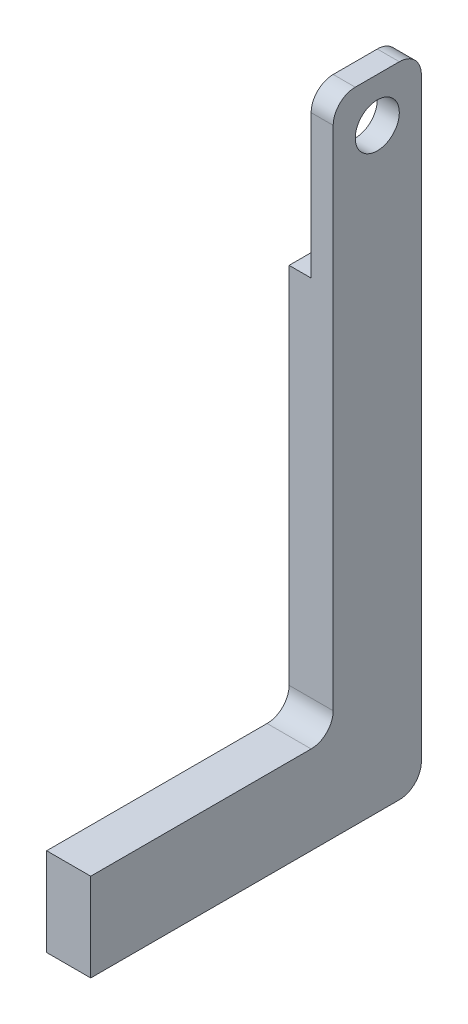
ISO-10303-21;
HEADER;
FILE_DESCRIPTION(('STEP AP214'),'2;1');
FILE_NAME('part.step','',(''),(''),'','','');
FILE_SCHEMA(('AUTOMOTIVE_DESIGN { 1 0 10303 214 1 1 1 1 }'));
ENDSEC;
DATA;
#1=APPLICATION_CONTEXT('core data for automotive mechanical design processes');
#2=APPLICATION_PROTOCOL_DEFINITION('international standard','automotive_design',2000,#1);
#3=PRODUCT_CONTEXT('',#1,'mechanical');
#4=PRODUCT('Part','Part','',(#3));
#5=PRODUCT_RELATED_PRODUCT_CATEGORY('part','',(#4));
#6=PRODUCT_DEFINITION_FORMATION('','',#4);
#7=PRODUCT_DEFINITION_CONTEXT('part definition',#1,'design');
#8=PRODUCT_DEFINITION('design','',#6,#7);
#9=PRODUCT_DEFINITION_SHAPE('','',#8);
#10=(LENGTH_UNIT() NAMED_UNIT(*) SI_UNIT(.MILLI.,.METRE.));
#11=(NAMED_UNIT(*) PLANE_ANGLE_UNIT() SI_UNIT($,.RADIAN.));
#12=(NAMED_UNIT(*) SI_UNIT($,.STERADIAN.) SOLID_ANGLE_UNIT());
#13=UNCERTAINTY_MEASURE_WITH_UNIT(LENGTH_MEASURE(1.E-05),#10,'distance_accuracy_value','');
#14=(GEOMETRIC_REPRESENTATION_CONTEXT(3) GLOBAL_UNCERTAINTY_ASSIGNED_CONTEXT((#13)) GLOBAL_UNIT_ASSIGNED_CONTEXT((#10,
#11,#12)) REPRESENTATION_CONTEXT('',''));
#15=CARTESIAN_POINT('',(0.,0.,0.));
#16=DIRECTION('',(0.,0.,1.));
#17=DIRECTION('',(1.,0.,0.));
#18=AXIS2_PLACEMENT_3D('',#15,#16,#17);
#19=CARTESIAN_POINT('',(20.,125.,-20.));
#20=DIRECTION('',(0.,0.,1.));
#21=DIRECTION('',(0.,-1.,0.));
#22=AXIS2_PLACEMENT_3D('',#19,#20,#21);
#23=PLANE('',#22);
#24=DIRECTION('',(0.,1.,0.));
#25=VECTOR('',#24,1.);
#26=CARTESIAN_POINT('',(20.,125.,-20.));
#27=LINE('',#26,#25);
#28=CARTESIAN_POINT('',(20.,-155.,-20.));
#29=VERTEX_POINT('',#28);
#30=CARTESIAN_POINT('',(20.,115.,-20.));
#31=VERTEX_POINT('',#30);
#32=EDGE_CURVE('E185',#29,#31,#27,.T.);
#33=ORIENTED_EDGE('',*,*,#32,.F.);
#34=DIRECTION('',(-1.,0.,0.));
#35=VECTOR('',#34,1.);
#36=CARTESIAN_POINT('',(0.,-155.,-20.));
#37=LINE('',#36,#35);
#38=CARTESIAN_POINT('',(0.,-155.,-20.));
#39=VERTEX_POINT('',#38);
#40=EDGE_CURVE('E212',#29,#39,#37,.T.);
#41=ORIENTED_EDGE('',*,*,#40,.T.);
#42=DIRECTION('',(0.,1.,0.));
#43=VECTOR('',#42,1.);
#44=CARTESIAN_POINT('',(0.,125.,-20.));
#45=LINE('',#44,#43);
#46=CARTESIAN_POINT('',(0.,50.0000000000001,-20.));
#47=VERTEX_POINT('',#46);
#48=EDGE_CURVE('E182',#39,#47,#45,.T.);
#49=ORIENTED_EDGE('',*,*,#48,.T.);
#50=DIRECTION('',(-1.,0.,0.));
#51=VECTOR('',#50,1.);
#52=CARTESIAN_POINT('',(10.,50.0000000000001,-20.));
#53=LINE('',#52,#51);
#54=CARTESIAN_POINT('',(10.,50.0000000000001,-20.));
#55=VERTEX_POINT('',#54);
#56=EDGE_CURVE('E177',#55,#47,#53,.T.);
#57=ORIENTED_EDGE('',*,*,#56,.F.);
#58=DIRECTION('',(0.,-1.,0.));
#59=VECTOR('',#58,1.);
#60=CARTESIAN_POINT('',(10.,125.,-20.));
#61=LINE('',#60,#59);
#62=CARTESIAN_POINT('',(10.,115.,-20.));
#63=VERTEX_POINT('',#62);
#64=EDGE_CURVE('E172',#63,#55,#61,.T.);
#65=ORIENTED_EDGE('',*,*,#64,.F.);
#66=DIRECTION('',(-1.,0.,0.));
#67=VECTOR('',#66,1.);
#68=CARTESIAN_POINT('',(20.,115.,-20.));
#69=LINE('',#68,#67);
#70=EDGE_CURVE('E202',#63,#31,#69,.F.);
#71=ORIENTED_EDGE('',*,*,#70,.T.);
#72=EDGE_LOOP('',(#33,#41,#49,#57,#65,#71));
#73=FACE_BOUND('',#72,.T.);
#74=ADVANCED_FACE('F32',(#73),#23,.F.);
#75=CARTESIAN_POINT('',(20.,125.,20.));
#76=DIRECTION('',(0.,-1.,0.));
#77=DIRECTION('',(0.,0.,-1.));
#78=AXIS2_PLACEMENT_3D('',#75,#76,#77);
#79=PLANE('',#78);
#80=DIRECTION('',(0.,0.,1.));
#81=VECTOR('',#80,1.);
#82=CARTESIAN_POINT('',(20.,125.,20.));
#83=LINE('',#82,#81);
#84=CARTESIAN_POINT('',(20.,125.,-9.99999999999998));
#85=VERTEX_POINT('',#84);
#86=CARTESIAN_POINT('',(20.,125.,10.));
#87=VERTEX_POINT('',#86);
#88=EDGE_CURVE('E187',#85,#87,#83,.T.);
#89=ORIENTED_EDGE('',*,*,#88,.F.);
#90=DIRECTION('',(-1.,0.,0.));
#91=VECTOR('',#90,1.);
#92=CARTESIAN_POINT('',(20.,125.,-9.99999999999998));
#93=LINE('',#92,#91);
#94=CARTESIAN_POINT('',(10.,125.,-9.99999999999998));
#95=VERTEX_POINT('',#94);
#96=EDGE_CURVE('E195',#85,#95,#93,.T.);
#97=ORIENTED_EDGE('',*,*,#96,.T.);
#98=DIRECTION('',(0.,0.,-1.));
#99=VECTOR('',#98,1.);
#100=CARTESIAN_POINT('',(10.,125.,20.));
#101=LINE('',#100,#99);
#102=CARTESIAN_POINT('',(10.,125.,10.));
#103=VERTEX_POINT('',#102);
#104=EDGE_CURVE('E169',#103,#95,#101,.T.);
#105=ORIENTED_EDGE('',*,*,#104,.F.);
#106=DIRECTION('',(-1.,0.,0.));
#107=VECTOR('',#106,1.);
#108=CARTESIAN_POINT('',(20.,125.,10.));
#109=LINE('',#108,#107);
#110=EDGE_CURVE('E193',#103,#87,#109,.F.);
#111=ORIENTED_EDGE('',*,*,#110,.T.);
#112=EDGE_LOOP('',(#89,#97,#105,#111));
#113=FACE_BOUND('',#112,.T.);
#114=ADVANCED_FACE('F251',(#113),#79,.F.);
#115=CARTESIAN_POINT('',(20.,125.,20.));
#116=DIRECTION('',(0.,0.,-1.));
#117=DIRECTION('',(0.,1.,0.));
#118=AXIS2_PLACEMENT_3D('',#115,#116,#117);
#119=PLANE('',#118);
#120=DIRECTION('',(0.,-1.,0.));
#121=VECTOR('',#120,1.);
#122=CARTESIAN_POINT('',(0.,125.,20.));
#123=LINE('',#122,#121);
#124=CARTESIAN_POINT('',(0.,50.0000000000001,20.));
#125=VERTEX_POINT('',#124);
#126=CARTESIAN_POINT('',(0.,-115.,20.));
#127=VERTEX_POINT('',#126);
#128=EDGE_CURVE('E188',#125,#127,#123,.T.);
#129=ORIENTED_EDGE('',*,*,#128,.T.);
#130=DIRECTION('',(-1.,0.,0.));
#131=VECTOR('',#130,1.);
#132=CARTESIAN_POINT('',(20.,-115.,20.));
#133=LINE('',#132,#131);
#134=CARTESIAN_POINT('',(20.,-115.,20.));
#135=VERTEX_POINT('',#134);
#136=EDGE_CURVE('E53',#127,#135,#133,.F.);
#137=ORIENTED_EDGE('',*,*,#136,.T.);
#138=DIRECTION('',(0.,-1.,0.));
#139=VECTOR('',#138,1.);
#140=CARTESIAN_POINT('',(20.,125.,20.));
#141=LINE('',#140,#139);
#142=CARTESIAN_POINT('',(20.,115.,20.));
#143=VERTEX_POINT('',#142);
#144=EDGE_CURVE('E191',#143,#135,#141,.T.);
#145=ORIENTED_EDGE('',*,*,#144,.F.);
#146=DIRECTION('',(-1.,0.,0.));
#147=VECTOR('',#146,1.);
#148=CARTESIAN_POINT('',(20.,115.,20.));
#149=LINE('',#148,#147);
#150=CARTESIAN_POINT('',(10.,115.,20.));
#151=VERTEX_POINT('',#150);
#152=EDGE_CURVE('E209',#143,#151,#149,.T.);
#153=ORIENTED_EDGE('',*,*,#152,.T.);
#154=DIRECTION('',(0.,1.,0.));
#155=VECTOR('',#154,1.);
#156=CARTESIAN_POINT('',(10.,125.,20.));
#157=LINE('',#156,#155);
#158=CARTESIAN_POINT('',(10.,50.0000000000001,20.));
#159=VERTEX_POINT('',#158);
#160=EDGE_CURVE('E166',#159,#151,#157,.T.);
#161=ORIENTED_EDGE('',*,*,#160,.F.);
#162=DIRECTION('',(-1.,0.,0.));
#163=VECTOR('',#162,1.);
#164=CARTESIAN_POINT('',(10.,50.0000000000001,20.));
#165=LINE('',#164,#163);
#166=EDGE_CURVE('E179',#159,#125,#165,.T.);
#167=ORIENTED_EDGE('',*,*,#166,.T.);
#168=EDGE_LOOP('',(#129,#137,#145,#153,#161,#167));
#169=FACE_BOUND('',#168,.T.);
#170=ADVANCED_FACE('F257',(#169),#119,.F.);
#171=CARTESIAN_POINT('',(20.,0.,0.));
#172=DIRECTION('',(1.,0.,0.));
#173=DIRECTION('',(0.,0.,-1.));
#174=AXIS2_PLACEMENT_3D('',#171,#172,#173);
#175=PLANE('',#174);
#176=CARTESIAN_POINT('',(20.,105.,0.));
#177=DIRECTION('',(1.,0.,0.));
#178=DIRECTION('',(0.,0.,-1.));
#179=AXIS2_PLACEMENT_3D('',#176,#177,#178);
#180=CIRCLE('',#179,10.);
#181=CARTESIAN_POINT('',(20.,105.,-9.99999999999998));
#182=VERTEX_POINT('',#181);
#183=EDGE_CURVE('E158',#182,#182,#180,.T.);
#184=ORIENTED_EDGE('',*,*,#183,.F.);
#185=EDGE_LOOP('',(#184));
#186=FACE_BOUND('',#185,.T.);
#187=DIRECTION('',(0.,0.,-1.));
#188=VECTOR('',#187,1.);
#189=CARTESIAN_POINT('',(20.,-165.,130.));
#190=LINE('',#189,#188);
#191=CARTESIAN_POINT('',(20.,-165.,130.));
#192=VERTEX_POINT('',#191);
#193=CARTESIAN_POINT('',(20.,-165.,-10.));
#194=VERTEX_POINT('',#193);
#195=EDGE_CURVE('E121',#192,#194,#190,.T.);
#196=ORIENTED_EDGE('',*,*,#195,.T.);
#197=CARTESIAN_POINT('',(20.,-155.,-10.));
#198=DIRECTION('',(1.,0.,0.));
#199=DIRECTION('',(0.,0.,-1.));
#200=AXIS2_PLACEMENT_3D('',#197,#198,#199);
#201=CIRCLE('',#200,10.);
#202=EDGE_CURVE('E224',#194,#29,#201,.T.);
#203=ORIENTED_EDGE('',*,*,#202,.T.);
#204=ORIENTED_EDGE('',*,*,#32,.T.);
#205=CARTESIAN_POINT('',(20.,115.,-9.99999999999998));
#206=DIRECTION('',(1.,0.,0.));
#207=DIRECTION('',(0.,0.,-1.));
#208=AXIS2_PLACEMENT_3D('',#205,#206,#207);
#209=CIRCLE('',#208,10.);
#210=EDGE_CURVE('E207',#31,#85,#209,.T.);
#211=ORIENTED_EDGE('',*,*,#210,.T.);
#212=ORIENTED_EDGE('',*,*,#88,.T.);
#213=CARTESIAN_POINT('',(20.,115.,10.));
#214=DIRECTION('',(1.,0.,0.));
#215=DIRECTION('',(0.,0.,-1.));
#216=AXIS2_PLACEMENT_3D('',#213,#214,#215);
#217=CIRCLE('',#216,10.);
#218=EDGE_CURVE('E205',#87,#143,#217,.T.);
#219=ORIENTED_EDGE('',*,*,#218,.T.);
#220=ORIENTED_EDGE('',*,*,#144,.T.);
#221=CARTESIAN_POINT('',(20.,-115.,30.));
#222=DIRECTION('',(1.,0.,0.));
#223=DIRECTION('',(0.,0.,-1.));
#224=AXIS2_PLACEMENT_3D('',#221,#222,#223);
#225=CIRCLE('',#224,10.);
#226=CARTESIAN_POINT('',(20.,-125.,30.));
#227=VERTEX_POINT('',#226);
#228=EDGE_CURVE('E11',#135,#227,#225,.F.);
#229=ORIENTED_EDGE('',*,*,#228,.T.);
#230=DIRECTION('',(0.,0.,-1.));
#231=VECTOR('',#230,1.);
#232=CARTESIAN_POINT('',(20.,-125.,130.));
#233=LINE('',#232,#231);
#234=CARTESIAN_POINT('',(20.,-125.,130.));
#235=VERTEX_POINT('',#234);
#236=EDGE_CURVE('E146',#235,#227,#233,.T.);
#237=ORIENTED_EDGE('',*,*,#236,.F.);
#238=DIRECTION('',(0.,-1.,0.));
#239=VECTOR('',#238,1.);
#240=CARTESIAN_POINT('',(20.,-125.,130.));
#241=LINE('',#240,#239);
#242=EDGE_CURVE('E139',#235,#192,#241,.T.);
#243=ORIENTED_EDGE('',*,*,#242,.T.);
#244=EDGE_LOOP('',(#196,#203,#204,#211,#212,#219,#220,#229,#237,#243));
#245=FACE_BOUND('',#244,.T.);
#246=ADVANCED_FACE('F144',(#186,#245),#175,.T.);
#247=CARTESIAN_POINT('',(0.,0.,0.));
#248=DIRECTION('',(1.,0.,0.));
#249=DIRECTION('',(0.,0.,-1.));
#250=AXIS2_PLACEMENT_3D('',#247,#248,#249);
#251=PLANE('',#250);
#252=ORIENTED_EDGE('',*,*,#48,.F.);
#253=CARTESIAN_POINT('',(0.,-155.,-10.));
#254=DIRECTION('',(1.,0.,0.));
#255=DIRECTION('',(0.,0.,-1.));
#256=AXIS2_PLACEMENT_3D('',#253,#254,#255);
#257=CIRCLE('',#256,10.);
#258=CARTESIAN_POINT('',(0.,-165.,-10.));
#259=VERTEX_POINT('',#258);
#260=EDGE_CURVE('E221',#39,#259,#257,.F.);
#261=ORIENTED_EDGE('',*,*,#260,.T.);
#262=DIRECTION('',(0.,0.,-1.));
#263=VECTOR('',#262,1.);
#264=CARTESIAN_POINT('',(0.,-165.,130.));
#265=LINE('',#264,#263);
#266=CARTESIAN_POINT('',(0.,-165.,130.));
#267=VERTEX_POINT('',#266);
#268=EDGE_CURVE('E131',#267,#259,#265,.T.);
#269=ORIENTED_EDGE('',*,*,#268,.F.);
#270=DIRECTION('',(0.,1.,0.));
#271=VECTOR('',#270,1.);
#272=CARTESIAN_POINT('',(0.,-125.,130.));
#273=LINE('',#272,#271);
#274=CARTESIAN_POINT('',(0.,-125.,130.));
#275=VERTEX_POINT('',#274);
#276=EDGE_CURVE('E142',#267,#275,#273,.T.);
#277=ORIENTED_EDGE('',*,*,#276,.T.);
#278=DIRECTION('',(0.,0.,-1.));
#279=VECTOR('',#278,1.);
#280=CARTESIAN_POINT('',(0.,-125.,130.));
#281=LINE('',#280,#279);
#282=CARTESIAN_POINT('',(0.,-125.,30.));
#283=VERTEX_POINT('',#282);
#284=EDGE_CURVE('E159',#275,#283,#281,.T.);
#285=ORIENTED_EDGE('',*,*,#284,.T.);
#286=CARTESIAN_POINT('',(0.,-115.,30.));
#287=DIRECTION('',(1.,0.,0.));
#288=DIRECTION('',(0.,0.,-1.));
#289=AXIS2_PLACEMENT_3D('',#286,#287,#288);
#290=CIRCLE('',#289,10.);
#291=EDGE_CURVE('E40',#283,#127,#290,.T.);
#292=ORIENTED_EDGE('',*,*,#291,.T.);
#293=ORIENTED_EDGE('',*,*,#128,.F.);
#294=DIRECTION('',(0.,0.,1.));
#295=VECTOR('',#294,1.);
#296=CARTESIAN_POINT('',(0.,50.0000000000001,20.));
#297=LINE('',#296,#295);
#298=EDGE_CURVE('E163',#47,#125,#297,.T.);
#299=ORIENTED_EDGE('',*,*,#298,.F.);
#300=EDGE_LOOP('',(#252,#261,#269,#277,#285,#292,#293,#299));
#301=FACE_BOUND('',#300,.T.);
#302=ADVANCED_FACE('F235',(#301),#251,.F.);
#303=CARTESIAN_POINT('',(10.,50.0000000000001,20.));
#304=DIRECTION('',(0.,-1.,0.));
#305=DIRECTION('',(0.,0.,-1.));
#306=AXIS2_PLACEMENT_3D('',#303,#304,#305);
#307=PLANE('',#306);
#308=ORIENTED_EDGE('',*,*,#298,.T.);
#309=ORIENTED_EDGE('',*,*,#166,.F.);
#310=DIRECTION('',(0.,0.,1.));
#311=VECTOR('',#310,1.);
#312=CARTESIAN_POINT('',(10.,50.0000000000001,20.));
#313=LINE('',#312,#311);
#314=EDGE_CURVE('E174',#55,#159,#313,.T.);
#315=ORIENTED_EDGE('',*,*,#314,.F.);
#316=ORIENTED_EDGE('',*,*,#56,.T.);
#317=EDGE_LOOP('',(#308,#309,#315,#316));
#318=FACE_BOUND('',#317,.T.);
#319=ADVANCED_FACE('F263',(#318),#307,.F.);
#320=CARTESIAN_POINT('',(10.,0.,0.));
#321=DIRECTION('',(1.,0.,0.));
#322=DIRECTION('',(0.,0.,-1.));
#323=AXIS2_PLACEMENT_3D('',#320,#321,#322);
#324=PLANE('',#323);
#325=CARTESIAN_POINT('',(10.,105.,0.));
#326=DIRECTION('',(1.,0.,0.));
#327=DIRECTION('',(0.,0.,-1.));
#328=AXIS2_PLACEMENT_3D('',#325,#326,#327);
#329=CIRCLE('',#328,10.);
#330=CARTESIAN_POINT('',(10.,105.,-9.99999999999998));
#331=VERTEX_POINT('',#330);
#332=EDGE_CURVE('E160',#331,#331,#329,.T.);
#333=ORIENTED_EDGE('',*,*,#332,.T.);
#334=EDGE_LOOP('',(#333));
#335=FACE_BOUND('',#334,.T.);
#336=ORIENTED_EDGE('',*,*,#104,.T.);
#337=CARTESIAN_POINT('',(10.,115.,-9.99999999999998));
#338=DIRECTION('',(1.,0.,0.));
#339=DIRECTION('',(0.,0.,-1.));
#340=AXIS2_PLACEMENT_3D('',#337,#338,#339);
#341=CIRCLE('',#340,10.);
#342=EDGE_CURVE('E200',#95,#63,#341,.F.);
#343=ORIENTED_EDGE('',*,*,#342,.T.);
#344=ORIENTED_EDGE('',*,*,#64,.T.);
#345=ORIENTED_EDGE('',*,*,#314,.T.);
#346=ORIENTED_EDGE('',*,*,#160,.T.);
#347=CARTESIAN_POINT('',(10.,115.,10.));
#348=DIRECTION('',(1.,0.,0.));
#349=DIRECTION('',(0.,0.,-1.));
#350=AXIS2_PLACEMENT_3D('',#347,#348,#349);
#351=CIRCLE('',#350,10.);
#352=EDGE_CURVE('E198',#151,#103,#351,.F.);
#353=ORIENTED_EDGE('',*,*,#352,.T.);
#354=EDGE_LOOP('',(#336,#343,#344,#345,#346,#353));
#355=FACE_BOUND('',#354,.T.);
#356=ADVANCED_FACE('F260',(#335,#355),#324,.F.);
#357=CARTESIAN_POINT('',(20.,115.,-9.99999999999998));
#358=DIRECTION('',(-1.,0.,0.));
#359=DIRECTION('',(0.,0.,1.));
#360=AXIS2_PLACEMENT_3D('',#357,#358,#359);
#361=CYLINDRICAL_SURFACE('',#360,10.);
#362=ORIENTED_EDGE('',*,*,#210,.F.);
#363=ORIENTED_EDGE('',*,*,#70,.F.);
#364=ORIENTED_EDGE('',*,*,#342,.F.);
#365=ORIENTED_EDGE('',*,*,#96,.F.);
#366=EDGE_LOOP('',(#362,#363,#364,#365));
#367=FACE_BOUND('',#366,.T.);
#368=ADVANCED_FACE('F247',(#367),#361,.T.);
#369=CARTESIAN_POINT('',(20.,115.,10.));
#370=DIRECTION('',(-1.,0.,0.));
#371=DIRECTION('',(0.,0.,1.));
#372=AXIS2_PLACEMENT_3D('',#369,#370,#371);
#373=CYLINDRICAL_SURFACE('',#372,10.);
#374=ORIENTED_EDGE('',*,*,#218,.F.);
#375=ORIENTED_EDGE('',*,*,#110,.F.);
#376=ORIENTED_EDGE('',*,*,#352,.F.);
#377=ORIENTED_EDGE('',*,*,#152,.F.);
#378=EDGE_LOOP('',(#374,#375,#376,#377));
#379=FACE_BOUND('',#378,.T.);
#380=ADVANCED_FACE('F255',(#379),#373,.T.);
#381=CARTESIAN_POINT('',(10.,105.,0.));
#382=DIRECTION('',(1.,0.,0.));
#383=DIRECTION('',(0.,0.,-1.));
#384=AXIS2_PLACEMENT_3D('',#381,#382,#383);
#385=CYLINDRICAL_SURFACE('',#384,10.);
#386=ORIENTED_EDGE('',*,*,#332,.F.);
#387=EDGE_LOOP('',(#386));
#388=FACE_BOUND('',#387,.T.);
#389=ORIENTED_EDGE('',*,*,#183,.T.);
#390=EDGE_LOOP('',(#389));
#391=FACE_BOUND('',#390,.T.);
#392=ADVANCED_FACE('F280',(#388,#391),#385,.F.);
#393=CARTESIAN_POINT('',(20.,-125.,130.));
#394=DIRECTION('',(0.,1.,0.));
#395=DIRECTION('',(0.,0.,1.));
#396=AXIS2_PLACEMENT_3D('',#393,#394,#395);
#397=PLANE('',#396);
#398=ORIENTED_EDGE('',*,*,#236,.T.);
#399=DIRECTION('',(-1.,0.,0.));
#400=VECTOR('',#399,1.);
#401=CARTESIAN_POINT('',(20.,-125.,30.));
#402=LINE('',#401,#400);
#403=EDGE_CURVE('E226',#227,#283,#402,.T.);
#404=ORIENTED_EDGE('',*,*,#403,.T.);
#405=ORIENTED_EDGE('',*,*,#284,.F.);
#406=DIRECTION('',(1.,0.,0.));
#407=VECTOR('',#406,1.);
#408=CARTESIAN_POINT('',(20.,-125.,130.));
#409=LINE('',#408,#407);
#410=EDGE_CURVE('E132',#275,#235,#409,.T.);
#411=ORIENTED_EDGE('',*,*,#410,.T.);
#412=EDGE_LOOP('',(#398,#404,#405,#411));
#413=FACE_BOUND('',#412,.T.);
#414=ADVANCED_FACE('F231',(#413),#397,.T.);
#415=CARTESIAN_POINT('',(20.,-165.,130.));
#416=DIRECTION('',(0.,-1.,0.));
#417=DIRECTION('',(0.,0.,-1.));
#418=AXIS2_PLACEMENT_3D('',#415,#416,#417);
#419=PLANE('',#418);
#420=ORIENTED_EDGE('',*,*,#268,.T.);
#421=DIRECTION('',(-1.,0.,0.));
#422=VECTOR('',#421,1.);
#423=CARTESIAN_POINT('',(20.,-165.,-10.));
#424=LINE('',#423,#422);
#425=EDGE_CURVE('E127',#259,#194,#424,.F.);
#426=ORIENTED_EDGE('',*,*,#425,.T.);
#427=ORIENTED_EDGE('',*,*,#195,.F.);
#428=DIRECTION('',(-1.,0.,0.));
#429=VECTOR('',#428,1.);
#430=CARTESIAN_POINT('',(20.,-165.,130.));
#431=LINE('',#430,#429);
#432=EDGE_CURVE('E125',#192,#267,#431,.T.);
#433=ORIENTED_EDGE('',*,*,#432,.T.);
#434=EDGE_LOOP('',(#420,#426,#427,#433));
#435=FACE_BOUND('',#434,.T.);
#436=ADVANCED_FACE('F124',(#435),#419,.T.);
#437=CARTESIAN_POINT('',(0.,0.,130.));
#438=DIRECTION('',(0.,0.,-1.));
#439=DIRECTION('',(0.,1.,0.));
#440=AXIS2_PLACEMENT_3D('',#437,#438,#439);
#441=PLANE('',#440);
#442=ORIENTED_EDGE('',*,*,#242,.F.);
#443=ORIENTED_EDGE('',*,*,#410,.F.);
#444=ORIENTED_EDGE('',*,*,#276,.F.);
#445=ORIENTED_EDGE('',*,*,#432,.F.);
#446=EDGE_LOOP('',(#442,#443,#444,#445));
#447=FACE_BOUND('',#446,.T.);
#448=ADVANCED_FACE('F137',(#447),#441,.F.);
#449=CARTESIAN_POINT('',(20.,-155.,-10.));
#450=DIRECTION('',(1.,0.,0.));
#451=DIRECTION('',(0.,0.,-1.));
#452=AXIS2_PLACEMENT_3D('',#449,#450,#451);
#453=CYLINDRICAL_SURFACE('',#452,10.);
#454=ORIENTED_EDGE('',*,*,#202,.F.);
#455=ORIENTED_EDGE('',*,*,#425,.F.);
#456=ORIENTED_EDGE('',*,*,#260,.F.);
#457=ORIENTED_EDGE('',*,*,#40,.F.);
#458=EDGE_LOOP('',(#454,#455,#456,#457));
#459=FACE_BOUND('',#458,.T.);
#460=ADVANCED_FACE('F237',(#459),#453,.T.);
#461=CARTESIAN_POINT('',(20.,-115.,30.));
#462=DIRECTION('',(-1.,0.,0.));
#463=DIRECTION('',(0.,0.,1.));
#464=AXIS2_PLACEMENT_3D('',#461,#462,#463);
#465=CYLINDRICAL_SURFACE('',#464,10.);
#466=ORIENTED_EDGE('',*,*,#228,.F.);
#467=ORIENTED_EDGE('',*,*,#136,.F.);
#468=ORIENTED_EDGE('',*,*,#291,.F.);
#469=ORIENTED_EDGE('',*,*,#403,.F.);
#470=EDGE_LOOP('',(#466,#467,#468,#469));
#471=FACE_BOUND('',#470,.T.);
#472=ADVANCED_FACE('F34',(#471),#465,.F.);
#473=CLOSED_SHELL('',(#74,#114,#170,#246,#302,#319,#356,#368,#380,#392,#414,#436,#448,#460,#472));
#474=MANIFOLD_SOLID_BREP('B2',#473);
#475=ADVANCED_BREP_SHAPE_REPRESENTATION('',(#18,#474),#14);
#476=SHAPE_DEFINITION_REPRESENTATION(#9,#475);
ENDSEC;
END-ISO-10303-21;
